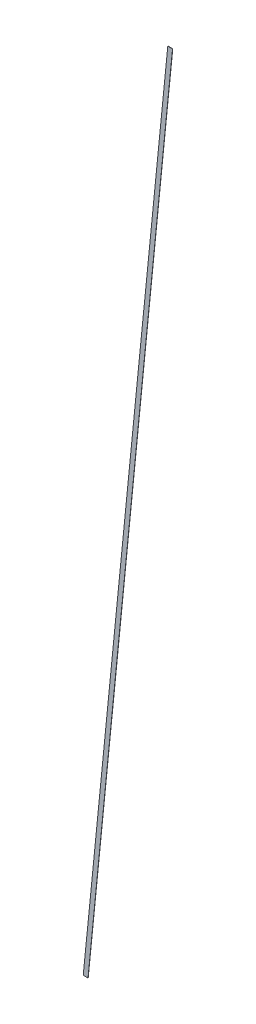
ISO-10303-21;
HEADER;
FILE_DESCRIPTION(('STEP AP214'),'2;1');
FILE_NAME('part.step','',(''),(''),'','','');
FILE_SCHEMA(('AUTOMOTIVE_DESIGN { 1 0 10303 214 1 1 1 1 }'));
ENDSEC;
DATA;
#1=APPLICATION_CONTEXT('core data for automotive mechanical design processes');
#2=APPLICATION_PROTOCOL_DEFINITION('international standard','automotive_design',2000,#1);
#3=PRODUCT_CONTEXT('',#1,'mechanical');
#4=PRODUCT('Part','Part','',(#3));
#5=PRODUCT_RELATED_PRODUCT_CATEGORY('part','',(#4));
#6=PRODUCT_DEFINITION_FORMATION('','',#4);
#7=PRODUCT_DEFINITION_CONTEXT('part definition',#1,'design');
#8=PRODUCT_DEFINITION('design','',#6,#7);
#9=PRODUCT_DEFINITION_SHAPE('','',#8);
#10=(LENGTH_UNIT() NAMED_UNIT(*) SI_UNIT(.MILLI.,.METRE.));
#11=(NAMED_UNIT(*) PLANE_ANGLE_UNIT() SI_UNIT($,.RADIAN.));
#12=(NAMED_UNIT(*) SI_UNIT($,.STERADIAN.) SOLID_ANGLE_UNIT());
#13=UNCERTAINTY_MEASURE_WITH_UNIT(LENGTH_MEASURE(1.E-05),#10,'distance_accuracy_value','');
#14=(GEOMETRIC_REPRESENTATION_CONTEXT(3) GLOBAL_UNCERTAINTY_ASSIGNED_CONTEXT((#13)) GLOBAL_UNIT_ASSIGNED_CONTEXT((#10,
#11,#12)) REPRESENTATION_CONTEXT('',''));
#15=CARTESIAN_POINT('',(0.,0.,0.));
#16=DIRECTION('',(0.,0.,1.));
#17=DIRECTION('',(1.,0.,0.));
#18=AXIS2_PLACEMENT_3D('',#15,#16,#17);
#19=CARTESIAN_POINT('',(68.5347271889202,-327.45906939983,0.635));
#20=DIRECTION('',(0.,0.,-1.));
#21=DIRECTION('',(-0.995055569965294,0.0993197497028837,0.));
#22=AXIS2_PLACEMENT_3D('',#19,#20,#21);
#23=PLANE('',#22);
#24=DIRECTION('',(-0.0993197497435986,-0.99505556996123,0.));
#25=VECTOR('',#24,1.);
#26=CARTESIAN_POINT('',(83.0524153783778,-159.944466256976,0.635));
#27=LINE('',#26,#25);
#28=CARTESIAN_POINT('',(66.9965534783843,-320.803458102494,0.635));
#29=VERTEX_POINT('',#28);
#30=CARTESIAN_POINT('',(99.1082772783534,0.914525588522448,0.635));
#31=VERTEX_POINT('',#30);
#32=EDGE_CURVE('E75',#29,#31,#27,.F.);
#33=ORIENTED_EDGE('',*,*,#32,.T.);
#34=DIRECTION('',(-1.,0.,0.));
#35=VECTOR('',#34,1.);
#36=CARTESIAN_POINT('',(100.014457824672,0.914525588522762,0.635));
#37=LINE('',#36,#35);
#38=CARTESIAN_POINT('',(100.92063837099,0.914525588523215,0.635));
#39=VERTEX_POINT('',#38);
#40=EDGE_CURVE('E69',#31,#39,#37,.F.);
#41=ORIENTED_EDGE('',*,*,#40,.T.);
#42=DIRECTION('',(0.0993197497435985,0.99505556996123,0.));
#43=VECTOR('',#42,1.);
#44=CARTESIAN_POINT('',(84.8647764709966,-159.944466256976,0.635));
#45=LINE('',#44,#43);
#46=CARTESIAN_POINT('',(68.80891457102,-320.803458102494,0.635));
#47=VERTEX_POINT('',#46);
#48=EDGE_CURVE('E58',#39,#47,#45,.F.);
#49=ORIENTED_EDGE('',*,*,#48,.T.);
#50=DIRECTION('',(1.,0.,0.));
#51=VECTOR('',#50,1.);
#52=CARTESIAN_POINT('',(67.9027340247023,-320.803458102494,0.635));
#53=LINE('',#52,#51);
#54=EDGE_CURVE('E54',#47,#29,#53,.F.);
#55=ORIENTED_EDGE('',*,*,#54,.T.);
#56=EDGE_LOOP('',(#33,#41,#49,#55));
#57=FACE_BOUND('',#56,.T.);
#58=ADVANCED_FACE('F17',(#57),#23,.T.);
#59=CARTESIAN_POINT('',(101.562872846975,7.34888526234232,0.712724));
#60=DIRECTION('',(0.99505556996123,-0.0993197497435985,0.));
#61=DIRECTION('',(-0.0993197497435985,-0.99505556996123,0.));
#62=AXIS2_PLACEMENT_3D('',#59,#60,#61);
#63=PLANE('',#62);
#64=ORIENTED_EDGE('',*,*,#48,.F.);
#65=DIRECTION('',(0.,0.,-1.));
#66=VECTOR('',#65,1.);
#67=CARTESIAN_POINT('',(100.920638370994,0.914525588522762,0.6731));
#68=LINE('',#67,#66);
#69=CARTESIAN_POINT('',(100.920638370994,0.914525588522768,0.7112));
#70=VERTEX_POINT('',#69);
#71=EDGE_CURVE('E67',#39,#70,#68,.F.);
#72=ORIENTED_EDGE('',*,*,#71,.T.);
#73=DIRECTION('',(-0.0993197497436662,-0.995055569961224,0.));
#74=VECTOR('',#73,1.);
#75=CARTESIAN_POINT('',(84.8558375321268,-160.034022875295,0.7112));
#76=LINE('',#75,#74);
#77=CARTESIAN_POINT('',(68.8089145710182,-320.803458102494,0.7112));
#78=VERTEX_POINT('',#77);
#79=EDGE_CURVE('E62',#70,#78,#76,.T.);
#80=ORIENTED_EDGE('',*,*,#79,.T.);
#81=DIRECTION('',(0.,0.,1.));
#82=VECTOR('',#81,1.);
#83=CARTESIAN_POINT('',(68.8089145710244,-320.803458102494,0.6731));
#84=LINE('',#83,#82);
#85=EDGE_CURVE('E49',#78,#47,#84,.F.);
#86=ORIENTED_EDGE('',*,*,#85,.T.);
#87=EDGE_LOOP('',(#64,#72,#80,#86));
#88=FACE_BOUND('',#87,.T.);
#89=ADVANCED_FACE('F65',(#88),#63,.T.);
#90=CARTESIAN_POINT('',(69.1971165376974,-320.803458102494,0.712724));
#91=DIRECTION('',(0.,-1.,0.));
#92=DIRECTION('',(-1.,0.,0.));
#93=AXIS2_PLACEMENT_3D('',#90,#91,#92);
#94=PLANE('',#93);
#95=ORIENTED_EDGE('',*,*,#54,.F.);
#96=ORIENTED_EDGE('',*,*,#85,.F.);
#97=DIRECTION('',(-1.,0.,0.));
#98=VECTOR('',#97,1.);
#99=CARTESIAN_POINT('',(69.1971165376974,-320.803458102494,0.7112));
#100=LINE('',#99,#98);
#101=CARTESIAN_POINT('',(66.9965534783884,-320.803458102494,0.7112));
#102=VERTEX_POINT('',#101);
#103=EDGE_CURVE('E21',#78,#102,#100,.T.);
#104=ORIENTED_EDGE('',*,*,#103,.T.);
#105=DIRECTION('',(0.,0.,1.));
#106=VECTOR('',#105,1.);
#107=CARTESIAN_POINT('',(66.9965534783966,-320.803458102496,0.6731));
#108=LINE('',#107,#106);
#109=EDGE_CURVE('E73',#102,#29,#108,.F.);
#110=ORIENTED_EDGE('',*,*,#109,.T.);
#111=EDGE_LOOP('',(#95,#96,#104,#110));
#112=FACE_BOUND('',#111,.T.);
#113=ADVANCED_FACE('F51',(#112),#94,.T.);
#114=CARTESIAN_POINT('',(66.3543190023996,-327.237817776294,0.712724));
#115=DIRECTION('',(-0.99505556996123,0.0993197497435986,0.));
#116=DIRECTION('',(0.0993197497435986,0.99505556996123,0.));
#117=AXIS2_PLACEMENT_3D('',#114,#115,#116);
#118=PLANE('',#117);
#119=ORIENTED_EDGE('',*,*,#32,.F.);
#120=ORIENTED_EDGE('',*,*,#109,.F.);
#121=DIRECTION('',(0.0993197497436442,0.995055569961226,0.));
#122=VECTOR('',#121,1.);
#123=CARTESIAN_POINT('',(83.0613543172472,-159.854909638644,0.7112));
#124=LINE('',#123,#122);
#125=CARTESIAN_POINT('',(99.1082772783526,0.914525588522747,0.7112));
#126=VERTEX_POINT('',#125);
#127=EDGE_CURVE('E27',#102,#126,#124,.T.);
#128=ORIENTED_EDGE('',*,*,#127,.T.);
#129=DIRECTION('',(0.,0.,1.));
#130=VECTOR('',#129,1.);
#131=CARTESIAN_POINT('',(99.10827727835,0.914525588522762,0.6731));
#132=LINE('',#131,#130);
#133=EDGE_CURVE('E33',#126,#31,#132,.F.);
#134=ORIENTED_EDGE('',*,*,#133,.T.);
#135=EDGE_LOOP('',(#119,#120,#128,#134));
#136=FACE_BOUND('',#135,.T.);
#137=ADVANCED_FACE('F90',(#136),#118,.T.);
#138=CARTESIAN_POINT('',(98.720075311677,0.914525588522762,0.712724));
#139=DIRECTION('',(0.,1.,0.));
#140=DIRECTION('',(1.,0.,0.));
#141=AXIS2_PLACEMENT_3D('',#138,#139,#140);
#142=PLANE('',#141);
#143=ORIENTED_EDGE('',*,*,#40,.F.);
#144=ORIENTED_EDGE('',*,*,#133,.F.);
#145=DIRECTION('',(1.,0.,0.));
#146=VECTOR('',#145,1.);
#147=CARTESIAN_POINT('',(98.720075311677,0.914525588522762,0.7112));
#148=LINE('',#147,#146);
#149=EDGE_CURVE('E11',#126,#70,#148,.T.);
#150=ORIENTED_EDGE('',*,*,#149,.T.);
#151=ORIENTED_EDGE('',*,*,#71,.F.);
#152=EDGE_LOOP('',(#143,#144,#150,#151));
#153=FACE_BOUND('',#152,.T.);
#154=ADVANCED_FACE('F89',(#153),#142,.T.);
#155=CARTESIAN_POINT('',(68.5347271889202,-327.45906939983,0.7112));
#156=DIRECTION('',(0.,0.,-1.));
#157=DIRECTION('',(-0.995055569965294,0.0993197497028837,0.));
#158=AXIS2_PLACEMENT_3D('',#155,#156,#157);
#159=PLANE('',#158);
#160=ORIENTED_EDGE('',*,*,#127,.F.);
#161=ORIENTED_EDGE('',*,*,#103,.F.);
#162=ORIENTED_EDGE('',*,*,#79,.F.);
#163=ORIENTED_EDGE('',*,*,#149,.F.);
#164=EDGE_LOOP('',(#160,#161,#162,#163));
#165=FACE_BOUND('',#164,.T.);
#166=ADVANCED_FACE('F19',(#165),#159,.F.);
#167=CLOSED_SHELL('',(#58,#89,#113,#137,#154,#166));
#168=MANIFOLD_SOLID_BREP('B1',#167);
#169=ADVANCED_BREP_SHAPE_REPRESENTATION('',(#18,#168),#14);
#170=SHAPE_DEFINITION_REPRESENTATION(#9,#169);
ENDSEC;
END-ISO-10303-21;
